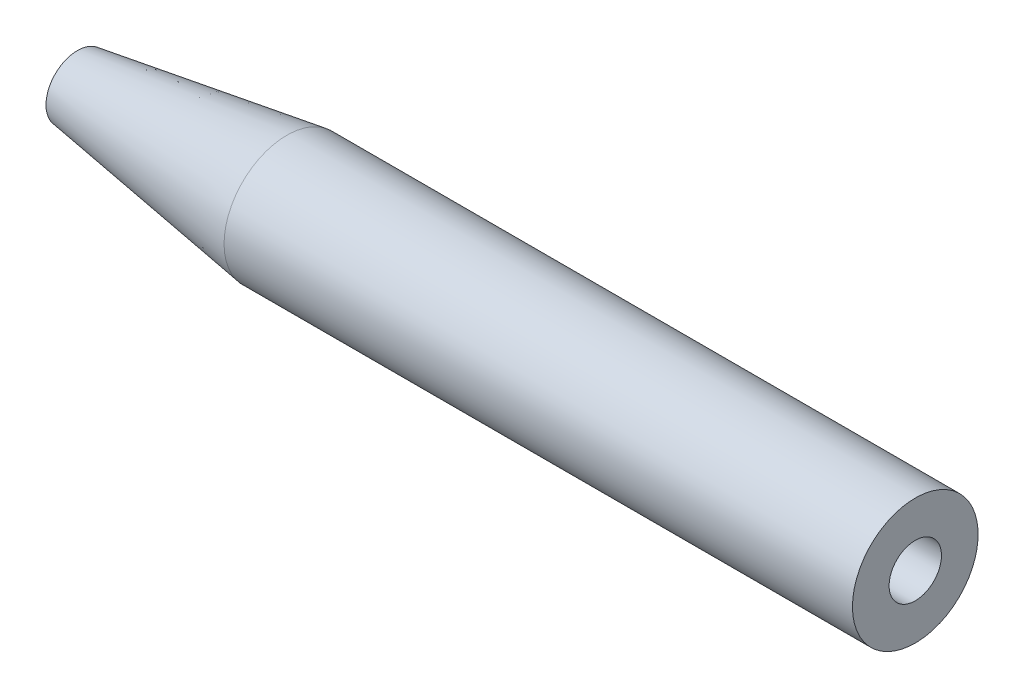
ISO-10303-21;
HEADER;
FILE_DESCRIPTION(('STEP AP214'),'2;1');
FILE_NAME('part.step','',(''),(''),'','','');
FILE_SCHEMA(('AUTOMOTIVE_DESIGN { 1 0 10303 214 1 1 1 1 }'));
ENDSEC;
DATA;
#1=APPLICATION_CONTEXT('core data for automotive mechanical design processes');
#2=APPLICATION_PROTOCOL_DEFINITION('international standard','automotive_design',2000,#1);
#3=PRODUCT_CONTEXT('',#1,'mechanical');
#4=PRODUCT('Part','Part','',(#3));
#5=PRODUCT_RELATED_PRODUCT_CATEGORY('part','',(#4));
#6=PRODUCT_DEFINITION_FORMATION('','',#4);
#7=PRODUCT_DEFINITION_CONTEXT('part definition',#1,'design');
#8=PRODUCT_DEFINITION('design','',#6,#7);
#9=PRODUCT_DEFINITION_SHAPE('','',#8);
#10=(LENGTH_UNIT() NAMED_UNIT(*) SI_UNIT(.MILLI.,.METRE.));
#11=(NAMED_UNIT(*) PLANE_ANGLE_UNIT() SI_UNIT($,.RADIAN.));
#12=(NAMED_UNIT(*) SI_UNIT($,.STERADIAN.) SOLID_ANGLE_UNIT());
#13=UNCERTAINTY_MEASURE_WITH_UNIT(LENGTH_MEASURE(1.E-05),#10,'distance_accuracy_value','');
#14=(GEOMETRIC_REPRESENTATION_CONTEXT(3) GLOBAL_UNCERTAINTY_ASSIGNED_CONTEXT((#13)) GLOBAL_UNIT_ASSIGNED_CONTEXT((#10,
#11,#12)) REPRESENTATION_CONTEXT('',''));
#15=CARTESIAN_POINT('',(0.,0.,0.));
#16=DIRECTION('',(0.,0.,1.));
#17=DIRECTION('',(1.,0.,0.));
#18=AXIS2_PLACEMENT_3D('',#15,#16,#17);
#19=CARTESIAN_POINT('',(0.,0.,0.));
#20=DIRECTION('',(-1.,0.,0.));
#21=DIRECTION('',(0.,0.,1.));
#22=AXIS2_PLACEMENT_3D('',#19,#20,#21);
#23=PLANE('',#22);
#24=CARTESIAN_POINT('',(0.,0.,0.));
#25=DIRECTION('',(1.,0.,0.));
#26=DIRECTION('',(0.,0.,-1.));
#27=AXIS2_PLACEMENT_3D('',#24,#25,#26);
#28=CIRCLE('',#27,1.24999999999999);
#29=CARTESIAN_POINT('',(0.,0.,-1.24999999999999));
#30=VERTEX_POINT('',#29);
#31=EDGE_CURVE('E60',#30,#30,#28,.T.);
#32=ORIENTED_EDGE('',*,*,#31,.F.);
#33=EDGE_LOOP('',(#32));
#34=FACE_BOUND('',#33,.T.);
#35=CARTESIAN_POINT('',(0.,0.,0.));
#36=DIRECTION('',(-1.,0.,0.));
#37=DIRECTION('',(0.,0.,1.));
#38=AXIS2_PLACEMENT_3D('',#35,#36,#37);
#39=CIRCLE('',#38,3.);
#40=CARTESIAN_POINT('',(0.,0.,3.));
#41=VERTEX_POINT('',#40);
#42=EDGE_CURVE('E11',#41,#41,#39,.T.);
#43=ORIENTED_EDGE('',*,*,#42,.F.);
#44=EDGE_LOOP('',(#43));
#45=FACE_BOUND('',#44,.T.);
#46=ADVANCED_FACE('F40',(#34,#45),#23,.F.);
#47=CARTESIAN_POINT('',(0.,0.,0.));
#48=DIRECTION('',(-1.,0.,0.));
#49=DIRECTION('',(0.,0.,1.));
#50=AXIS2_PLACEMENT_3D('',#47,#48,#49);
#51=CYLINDRICAL_SURFACE('',#50,3.);
#52=CARTESIAN_POINT('',(-30.,0.,0.));
#53=DIRECTION('',(-1.,0.,0.));
#54=DIRECTION('',(0.,0.,1.));
#55=AXIS2_PLACEMENT_3D('',#52,#53,#54);
#56=CIRCLE('',#55,3.);
#57=CARTESIAN_POINT('',(-30.,0.,3.));
#58=VERTEX_POINT('',#57);
#59=EDGE_CURVE('E46',#58,#58,#56,.T.);
#60=ORIENTED_EDGE('',*,*,#59,.F.);
#61=EDGE_LOOP('',(#60));
#62=FACE_BOUND('',#61,.T.);
#63=ORIENTED_EDGE('',*,*,#42,.T.);
#64=EDGE_LOOP('',(#63));
#65=FACE_BOUND('',#64,.T.);
#66=ADVANCED_FACE('F71',(#62,#65),#51,.T.);
#67=CARTESIAN_POINT('',(-30.,0.,0.));
#68=DIRECTION('',(1.,0.,0.));
#69=DIRECTION('',(0.,0.,-1.));
#70=AXIS2_PLACEMENT_3D('',#67,#68,#69);
#71=CONICAL_SURFACE('',#70,3.,0.148889947609497);
#72=CARTESIAN_POINT('',(-40.,0.,0.));
#73=DIRECTION('',(-1.,0.,0.));
#74=DIRECTION('',(0.,0.,1.));
#75=AXIS2_PLACEMENT_3D('',#72,#73,#74);
#76=CIRCLE('',#75,1.5);
#77=CARTESIAN_POINT('',(-40.,0.,1.5));
#78=VERTEX_POINT('',#77);
#79=EDGE_CURVE('E59',#78,#78,#76,.T.);
#80=ORIENTED_EDGE('',*,*,#79,.F.);
#81=EDGE_LOOP('',(#80));
#82=FACE_BOUND('',#81,.T.);
#83=ORIENTED_EDGE('',*,*,#59,.T.);
#84=EDGE_LOOP('',(#83));
#85=FACE_BOUND('',#84,.T.);
#86=ADVANCED_FACE('F69',(#82,#85),#71,.T.);
#87=CARTESIAN_POINT('',(-40.,0.,-1.5));
#88=DIRECTION('',(1.,0.,0.));
#89=DIRECTION('',(0.,0.,-1.));
#90=AXIS2_PLACEMENT_3D('',#87,#88,#89);
#91=PLANE('',#90);
#92=ORIENTED_EDGE('',*,*,#79,.T.);
#93=EDGE_LOOP('',(#92));
#94=FACE_BOUND('',#93,.T.);
#95=ADVANCED_FACE('F53',(#94),#91,.F.);
#96=CARTESIAN_POINT('',(-8.74892422621555,0.,0.));
#97=DIRECTION('',(1.,0.,0.));
#98=DIRECTION('',(0.,0.,-1.));
#99=AXIS2_PLACEMENT_3D('',#96,#97,#98);
#100=CONICAL_SURFACE('',#99,1.25,1.02974425867665);
#101=CARTESIAN_POINT('',(-9.5,0.,0.));
#102=VERTEX_POINT('',#101);
#103=VERTEX_LOOP('',#102);
#104=FACE_BOUND('',#103,.T.);
#105=CARTESIAN_POINT('',(-8.74892422621555,0.,0.));
#106=DIRECTION('',(1.,0.,0.));
#107=DIRECTION('',(0.,0.,-1.));
#108=AXIS2_PLACEMENT_3D('',#105,#106,#107);
#109=CIRCLE('',#108,1.25);
#110=CARTESIAN_POINT('',(-8.74892422621555,0.,-1.25));
#111=VERTEX_POINT('',#110);
#112=EDGE_CURVE('E57',#111,#111,#109,.T.);
#113=ORIENTED_EDGE('',*,*,#112,.T.);
#114=EDGE_LOOP('',(#113));
#115=FACE_BOUND('',#114,.T.);
#116=ADVANCED_FACE('F49',(#104,#115),#100,.F.);
#117=CARTESIAN_POINT('',(0.,0.,0.));
#118=DIRECTION('',(1.,0.,0.));
#119=DIRECTION('',(0.,0.,-1.));
#120=AXIS2_PLACEMENT_3D('',#117,#118,#119);
#121=CYLINDRICAL_SURFACE('',#120,1.24999999999999);
#122=ORIENTED_EDGE('',*,*,#112,.F.);
#123=EDGE_LOOP('',(#122));
#124=FACE_BOUND('',#123,.T.);
#125=ORIENTED_EDGE('',*,*,#31,.T.);
#126=EDGE_LOOP('',(#125));
#127=FACE_BOUND('',#126,.T.);
#128=ADVANCED_FACE('F52',(#124,#127),#121,.F.);
#129=CLOSED_SHELL('',(#46,#66,#86,#95,#116,#128));
#130=MANIFOLD_SOLID_BREP('B2',#129);
#131=ADVANCED_BREP_SHAPE_REPRESENTATION('',(#18,#130),#14);
#132=SHAPE_DEFINITION_REPRESENTATION(#9,#131);
ENDSEC;
END-ISO-10303-21;
